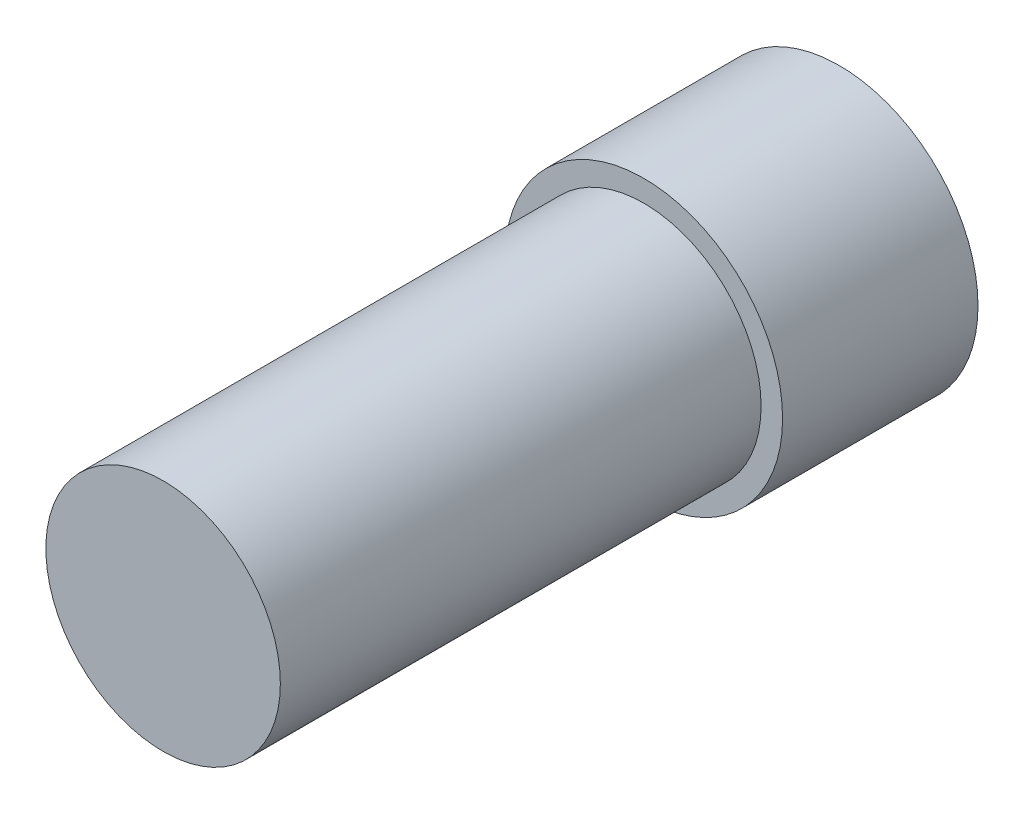
ISO-10303-21;
HEADER;
FILE_DESCRIPTION(('STEP AP214'),'2;1');
FILE_NAME('part.step','',(''),(''),'','','');
FILE_SCHEMA(('AUTOMOTIVE_DESIGN { 1 0 10303 214 1 1 1 1 }'));
ENDSEC;
DATA;
#1=APPLICATION_CONTEXT('core data for automotive mechanical design processes');
#2=APPLICATION_PROTOCOL_DEFINITION('international standard','automotive_design',2000,#1);
#3=PRODUCT_CONTEXT('',#1,'mechanical');
#4=PRODUCT('Part','Part','',(#3));
#5=PRODUCT_RELATED_PRODUCT_CATEGORY('part','',(#4));
#6=PRODUCT_DEFINITION_FORMATION('','',#4);
#7=PRODUCT_DEFINITION_CONTEXT('part definition',#1,'design');
#8=PRODUCT_DEFINITION('design','',#6,#7);
#9=PRODUCT_DEFINITION_SHAPE('','',#8);
#10=(LENGTH_UNIT() NAMED_UNIT(*) SI_UNIT(.MILLI.,.METRE.));
#11=(NAMED_UNIT(*) PLANE_ANGLE_UNIT() SI_UNIT($,.RADIAN.));
#12=(NAMED_UNIT(*) SI_UNIT($,.STERADIAN.) SOLID_ANGLE_UNIT());
#13=UNCERTAINTY_MEASURE_WITH_UNIT(LENGTH_MEASURE(1.E-05),#10,'distance_accuracy_value','');
#14=(GEOMETRIC_REPRESENTATION_CONTEXT(3) GLOBAL_UNCERTAINTY_ASSIGNED_CONTEXT((#13)) GLOBAL_UNIT_ASSIGNED_CONTEXT((#10,
#11,#12)) REPRESENTATION_CONTEXT('',''));
#15=CARTESIAN_POINT('',(0.,0.,0.));
#16=DIRECTION('',(0.,0.,1.));
#17=DIRECTION('',(1.,0.,0.));
#18=AXIS2_PLACEMENT_3D('',#15,#16,#17);
#19=CARTESIAN_POINT('',(0.,0.,10.));
#20=DIRECTION('',(0.,0.,1.));
#21=DIRECTION('',(1.,0.,0.));
#22=AXIS2_PLACEMENT_3D('',#19,#20,#21);
#23=PLANE('',#22);
#24=CARTESIAN_POINT('',(0.,0.,10.));
#25=DIRECTION('',(0.,0.,1.));
#26=DIRECTION('',(1.,0.,0.));
#27=AXIS2_PLACEMENT_3D('',#24,#25,#26);
#28=CIRCLE('',#27,6.);
#29=CARTESIAN_POINT('',(6.,0.,10.));
#30=VERTEX_POINT('',#29);
#31=EDGE_CURVE('E10',#30,#30,#28,.T.);
#32=ORIENTED_EDGE('',*,*,#31,.F.);
#33=EDGE_LOOP('',(#32));
#34=FACE_BOUND('',#33,.T.);
#35=CARTESIAN_POINT('',(0.,0.,10.));
#36=DIRECTION('',(0.,0.,1.));
#37=DIRECTION('',(1.,0.,0.));
#38=AXIS2_PLACEMENT_3D('',#35,#36,#37);
#39=CIRCLE('',#38,7.1);
#40=CARTESIAN_POINT('',(7.1,0.,10.));
#41=VERTEX_POINT('',#40);
#42=EDGE_CURVE('E52',#41,#41,#39,.T.);
#43=ORIENTED_EDGE('',*,*,#42,.T.);
#44=EDGE_LOOP('',(#43));
#45=FACE_BOUND('',#44,.T.);
#46=ADVANCED_FACE('F43',(#34,#45),#23,.T.);
#47=CARTESIAN_POINT('',(0.,0.,0.));
#48=DIRECTION('',(0.,0.,1.));
#49=DIRECTION('',(1.,0.,0.));
#50=AXIS2_PLACEMENT_3D('',#47,#48,#49);
#51=PLANE('',#50);
#52=CARTESIAN_POINT('',(0.,0.,0.));
#53=DIRECTION('',(0.,0.,1.));
#54=DIRECTION('',(1.,0.,0.));
#55=AXIS2_PLACEMENT_3D('',#52,#53,#54);
#56=CIRCLE('',#55,7.1);
#57=CARTESIAN_POINT('',(7.1,0.,0.));
#58=VERTEX_POINT('',#57);
#59=EDGE_CURVE('E47',#58,#58,#56,.T.);
#60=ORIENTED_EDGE('',*,*,#59,.F.);
#61=EDGE_LOOP('',(#60));
#62=FACE_BOUND('',#61,.T.);
#63=CARTESIAN_POINT('',(0.,0.,0.));
#64=DIRECTION('',(0.,0.,1.));
#65=DIRECTION('',(1.,0.,0.));
#66=AXIS2_PLACEMENT_3D('',#63,#64,#65);
#67=CIRCLE('',#66,3.);
#68=CARTESIAN_POINT('',(3.,0.,0.));
#69=VERTEX_POINT('',#68);
#70=EDGE_CURVE('E67',#69,#69,#67,.T.);
#71=ORIENTED_EDGE('',*,*,#70,.T.);
#72=EDGE_LOOP('',(#71));
#73=FACE_BOUND('',#72,.T.);
#74=ADVANCED_FACE('F77',(#62,#73),#51,.F.);
#75=CARTESIAN_POINT('',(0.,0.,10.));
#76=DIRECTION('',(0.,0.,-1.));
#77=DIRECTION('',(-1.,0.,0.));
#78=AXIS2_PLACEMENT_3D('',#75,#76,#77);
#79=CYLINDRICAL_SURFACE('',#78,7.1);
#80=ORIENTED_EDGE('',*,*,#42,.F.);
#81=EDGE_LOOP('',(#80));
#82=FACE_BOUND('',#81,.T.);
#83=ORIENTED_EDGE('',*,*,#59,.T.);
#84=EDGE_LOOP('',(#83));
#85=FACE_BOUND('',#84,.T.);
#86=ADVANCED_FACE('F45',(#82,#85),#79,.T.);
#87=CARTESIAN_POINT('',(0.,0.,10.));
#88=DIRECTION('',(0.,0.,-1.));
#89=DIRECTION('',(-1.,0.,0.));
#90=AXIS2_PLACEMENT_3D('',#87,#88,#89);
#91=CYLINDRICAL_SURFACE('',#90,3.);
#92=CARTESIAN_POINT('',(0.,0.,10.));
#93=DIRECTION('',(0.,0.,1.));
#94=DIRECTION('',(1.,0.,0.));
#95=AXIS2_PLACEMENT_3D('',#92,#93,#94);
#96=CIRCLE('',#95,3.);
#97=CARTESIAN_POINT('',(3.,0.,10.));
#98=VERTEX_POINT('',#97);
#99=EDGE_CURVE('E63',#98,#98,#96,.T.);
#100=ORIENTED_EDGE('',*,*,#99,.T.);
#101=EDGE_LOOP('',(#100));
#102=FACE_BOUND('',#101,.T.);
#103=ORIENTED_EDGE('',*,*,#70,.F.);
#104=EDGE_LOOP('',(#103));
#105=FACE_BOUND('',#104,.T.);
#106=ADVANCED_FACE('F82',(#102,#105),#91,.F.);
#107=CARTESIAN_POINT('',(0.,0.,34.6));
#108=DIRECTION('',(0.,0.,1.));
#109=DIRECTION('',(-0.782115538828088,-0.623133439901639,0.));
#110=AXIS2_PLACEMENT_3D('',#107,#108,#109);
#111=PLANE('',#110);
#112=CARTESIAN_POINT('',(0.,0.,34.6));
#113=DIRECTION('',(0.,0.,1.));
#114=DIRECTION('',(1.,0.,0.));
#115=AXIS2_PLACEMENT_3D('',#112,#113,#114);
#116=CIRCLE('',#115,6.);
#117=CARTESIAN_POINT('',(6.,0.,34.6));
#118=VERTEX_POINT('',#117);
#119=EDGE_CURVE('E59',#118,#118,#116,.T.);
#120=ORIENTED_EDGE('',*,*,#119,.T.);
#121=EDGE_LOOP('',(#120));
#122=FACE_BOUND('',#121,.T.);
#123=ADVANCED_FACE('F90',(#122),#111,.T.);
#124=CARTESIAN_POINT('',(0.,0.,51.5705627484771));
#125=DIRECTION('',(0.,0.,-1.));
#126=DIRECTION('',(-1.,0.,0.));
#127=AXIS2_PLACEMENT_3D('',#124,#125,#126);
#128=CYLINDRICAL_SURFACE('',#127,6.);
#129=ORIENTED_EDGE('',*,*,#31,.T.);
#130=EDGE_LOOP('',(#129));
#131=FACE_BOUND('',#130,.T.);
#132=ORIENTED_EDGE('',*,*,#119,.F.);
#133=EDGE_LOOP('',(#132));
#134=FACE_BOUND('',#133,.T.);
#135=ADVANCED_FACE('F94',(#131,#134),#128,.T.);
#136=CARTESIAN_POINT('',(0.,0.,10.));
#137=DIRECTION('',(0.,0.,1.));
#138=DIRECTION('',(1.,0.,0.));
#139=AXIS2_PLACEMENT_3D('',#136,#137,#138);
#140=PLANE('',#139);
#141=ORIENTED_EDGE('',*,*,#99,.F.);
#142=EDGE_LOOP('',(#141));
#143=FACE_BOUND('',#142,.T.);
#144=ADVANCED_FACE('F98',(#143),#140,.F.);
#145=CLOSED_SHELL('',(#46,#74,#86,#106,#123,#135,#144));
#146=MANIFOLD_SOLID_BREP('B2',#145);
#147=ADVANCED_BREP_SHAPE_REPRESENTATION('',(#18,#146),#14);
#148=SHAPE_DEFINITION_REPRESENTATION(#9,#147);
ENDSEC;
END-ISO-10303-21;
